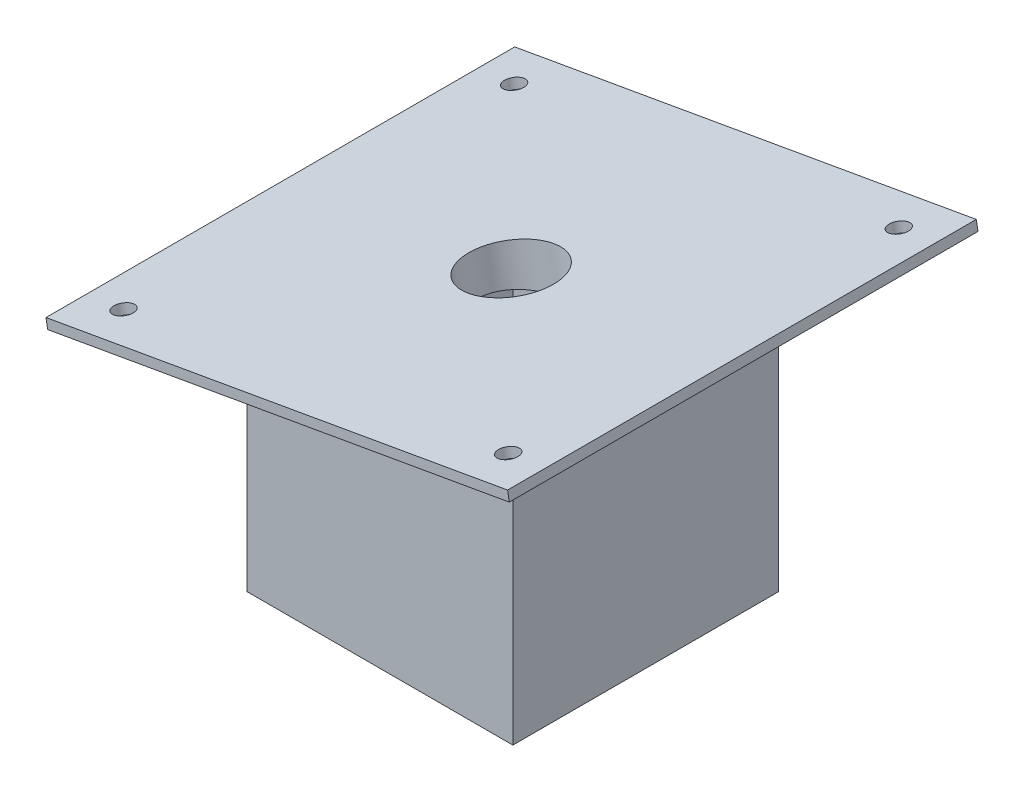
ISO-10303-21;
HEADER;
FILE_DESCRIPTION(('STEP AP214'),'2;1');
FILE_NAME('part.step','',(''),(''),'','','');
FILE_SCHEMA(('AUTOMOTIVE_DESIGN { 1 0 10303 214 1 1 1 1 }'));
ENDSEC;
DATA;
#1=APPLICATION_CONTEXT('core data for automotive mechanical design processes');
#2=APPLICATION_PROTOCOL_DEFINITION('international standard','automotive_design',2000,#1);
#3=PRODUCT_CONTEXT('',#1,'mechanical');
#4=PRODUCT('Part','Part','',(#3));
#5=PRODUCT_RELATED_PRODUCT_CATEGORY('part','',(#4));
#6=PRODUCT_DEFINITION_FORMATION('','',#4);
#7=PRODUCT_DEFINITION_CONTEXT('part definition',#1,'design');
#8=PRODUCT_DEFINITION('design','',#6,#7);
#9=PRODUCT_DEFINITION_SHAPE('','',#8);
#10=(LENGTH_UNIT() NAMED_UNIT(*) SI_UNIT(.MILLI.,.METRE.));
#11=(NAMED_UNIT(*) PLANE_ANGLE_UNIT() SI_UNIT($,.RADIAN.));
#12=(NAMED_UNIT(*) SI_UNIT($,.STERADIAN.) SOLID_ANGLE_UNIT());
#13=UNCERTAINTY_MEASURE_WITH_UNIT(LENGTH_MEASURE(1.E-05),#10,'distance_accuracy_value','');
#14=(GEOMETRIC_REPRESENTATION_CONTEXT(3) GLOBAL_UNCERTAINTY_ASSIGNED_CONTEXT((#13)) GLOBAL_UNIT_ASSIGNED_CONTEXT((#10,
#11,#12)) REPRESENTATION_CONTEXT('',''));
#15=CARTESIAN_POINT('',(0.,0.,0.));
#16=DIRECTION('',(0.,0.,1.));
#17=DIRECTION('',(1.,0.,0.));
#18=AXIS2_PLACEMENT_3D('',#15,#16,#17);
#19=CARTESIAN_POINT('',(-14.9866730086522,84.9936461705283,0.));
#20=DIRECTION('',(-0.173648177666923,0.984807753012209,0.));
#21=DIRECTION('',(-0.984807753012209,-0.173648177666923,0.));
#22=AXIS2_PLACEMENT_3D('',#19,#20,#21);
#23=PLANE('',#22);
#24=CARTESIAN_POINT('',(-62.5352923162753,76.6095416911593,-63.5));
#25=DIRECTION('',(-0.173648177666923,0.984807753012209,0.));
#26=DIRECTION('',(-0.984807753012209,-0.173648177666923,0.));
#27=AXIS2_PLACEMENT_3D('',#24,#25,#26);
#28=CIRCLE('',#27,3.17499999999999);
#29=CARTESIAN_POINT('',(-65.662056932089,76.0582087270668,-63.5));
#30=VERTEX_POINT('',#29);
#31=EDGE_CURVE('E287',#30,#30,#28,.F.);
#32=ORIENTED_EDGE('',*,*,#31,.F.);
#33=EDGE_LOOP('',(#32));
#34=FACE_BOUND('',#33,.T.);
#35=DIRECTION('',(0.,0.,-1.));
#36=VECTOR('',#35,1.);
#37=CARTESIAN_POINT('',(75.0423507795304,100.868192111228,-76.2));
#38=LINE('',#37,#36);
#39=CARTESIAN_POINT('',(75.0423507795304,100.868192111228,76.2));
#40=VERTEX_POINT('',#39);
#41=CARTESIAN_POINT('',(75.0423507795304,100.868192111228,-76.2));
#42=VERTEX_POINT('',#41);
#43=EDGE_CURVE('E162',#40,#42,#38,.T.);
#44=ORIENTED_EDGE('',*,*,#43,.F.);
#45=DIRECTION('',(0.984807753012209,0.173648177666923,0.));
#46=VECTOR('',#45,1.);
#47=CARTESIAN_POINT('',(-75.0423507795303,74.4042098347893,76.2));
#48=LINE('',#47,#46);
#49=CARTESIAN_POINT('',(-75.0423507795303,74.4042098347893,76.2));
#50=VERTEX_POINT('',#49);
#51=EDGE_CURVE('E158',#50,#40,#48,.T.);
#52=ORIENTED_EDGE('',*,*,#51,.F.);
#53=DIRECTION('',(0.,0.,1.));
#54=VECTOR('',#53,1.);
#55=CARTESIAN_POINT('',(-75.0423507795304,74.4042098347893,-76.2));
#56=LINE('',#55,#54);
#57=CARTESIAN_POINT('',(-75.0423507795304,74.4042098347893,-76.2));
#58=VERTEX_POINT('',#57);
#59=EDGE_CURVE('E319',#58,#50,#56,.T.);
#60=ORIENTED_EDGE('',*,*,#59,.F.);
#61=DIRECTION('',(-0.984807753012209,-0.173648177666923,0.));
#62=VECTOR('',#61,1.);
#63=CARTESIAN_POINT('',(-75.0423507795304,74.4042098347893,-76.2));
#64=LINE('',#63,#62);
#65=EDGE_CURVE('E316',#42,#58,#64,.T.);
#66=ORIENTED_EDGE('',*,*,#65,.F.);
#67=EDGE_LOOP('',(#44,#52,#60,#66));
#68=FACE_BOUND('',#67,.T.);
#69=DIRECTION('',(-0.984807753012209,-0.173648177666923,0.));
#70=VECTOR('',#69,1.);
#71=CARTESIAN_POINT('',(43.18,95.25,43.18));
#72=LINE('',#71,#70);
#73=CARTESIAN_POINT('',(43.18,95.2500000000001,43.18));
#74=VERTEX_POINT('',#73);
#75=CARTESIAN_POINT('',(-43.18,80.0224019460176,43.18));
#76=VERTEX_POINT('',#75);
#77=EDGE_CURVE('E168',#74,#76,#72,.T.);
#78=ORIENTED_EDGE('',*,*,#77,.F.);
#79=DIRECTION('',(0.,0.,-1.));
#80=VECTOR('',#79,1.);
#81=CARTESIAN_POINT('',(43.18,95.25,-43.18));
#82=LINE('',#81,#80);
#83=CARTESIAN_POINT('',(43.18,95.2500000000001,-43.18));
#84=VERTEX_POINT('',#83);
#85=EDGE_CURVE('E224',#74,#84,#82,.T.);
#86=ORIENTED_EDGE('',*,*,#85,.T.);
#87=DIRECTION('',(-0.984807753012209,-0.173648177666923,0.));
#88=VECTOR('',#87,1.);
#89=CARTESIAN_POINT('',(43.18,95.25,-43.18));
#90=LINE('',#89,#88);
#91=CARTESIAN_POINT('',(-43.18,80.0224019460177,-43.18));
#92=VERTEX_POINT('',#91);
#93=EDGE_CURVE('E164',#84,#92,#90,.T.);
#94=ORIENTED_EDGE('',*,*,#93,.T.);
#95=DIRECTION('',(0.,0.,-1.));
#96=VECTOR('',#95,1.);
#97=CARTESIAN_POINT('',(-43.18,80.0224019460176,43.18));
#98=LINE('',#97,#96);
#99=EDGE_CURVE('E176',#76,#92,#98,.T.);
#100=ORIENTED_EDGE('',*,*,#99,.F.);
#101=EDGE_LOOP('',(#78,#86,#94,#100));
#102=FACE_BOUND('',#101,.T.);
#103=CARTESIAN_POINT('',(-62.5352923162752,76.6095416911593,63.5));
#104=DIRECTION('',(-0.173648177666923,0.984807753012209,0.));
#105=DIRECTION('',(-0.984807753012209,-0.173648177666923,0.));
#106=AXIS2_PLACEMENT_3D('',#103,#104,#105);
#107=CIRCLE('',#106,3.17499999999999);
#108=CARTESIAN_POINT('',(-65.662056932089,76.0582087270668,63.5));
#109=VERTEX_POINT('',#108);
#110=EDGE_CURVE('E269',#109,#109,#107,.F.);
#111=ORIENTED_EDGE('',*,*,#110,.F.);
#112=EDGE_LOOP('',(#111));
#113=FACE_BOUND('',#112,.T.);
#114=CARTESIAN_POINT('',(62.5352923162753,98.6628602548585,63.5));
#115=DIRECTION('',(-0.173648177666923,0.984807753012209,0.));
#116=DIRECTION('',(-0.984807753012209,-0.173648177666923,0.));
#117=AXIS2_PLACEMENT_3D('',#114,#115,#116);
#118=CIRCLE('',#117,3.17499999999999);
#119=CARTESIAN_POINT('',(59.4085277004615,98.111527290766,63.5));
#120=VERTEX_POINT('',#119);
#121=EDGE_CURVE('E273',#120,#120,#118,.F.);
#122=ORIENTED_EDGE('',*,*,#121,.F.);
#123=EDGE_LOOP('',(#122));
#124=FACE_BOUND('',#123,.T.);
#125=CARTESIAN_POINT('',(62.5352923162753,98.6628602548585,-63.5));
#126=DIRECTION('',(-0.173648177666923,0.984807753012209,0.));
#127=DIRECTION('',(-0.984807753012209,-0.173648177666923,0.));
#128=AXIS2_PLACEMENT_3D('',#125,#126,#127);
#129=CIRCLE('',#128,3.17499999999999);
#130=CARTESIAN_POINT('',(59.4085277004615,98.111527290766,-63.5));
#131=VERTEX_POINT('',#130);
#132=EDGE_CURVE('E276',#131,#131,#129,.F.);
#133=ORIENTED_EDGE('',*,*,#132,.F.);
#134=EDGE_LOOP('',(#133));
#135=FACE_BOUND('',#134,.T.);
#136=ADVANCED_FACE('F45',(#34,#68,#102,#113,#124,#135),#23,.F.);
#137=CARTESIAN_POINT('',(43.18,95.25,-43.18));
#138=DIRECTION('',(-1.,0.,0.));
#139=DIRECTION('',(0.,0.,1.));
#140=AXIS2_PLACEMENT_3D('',#137,#138,#139);
#141=PLANE('',#140);
#142=DIRECTION('',(0.,0.,-1.));
#143=VECTOR('',#142,1.);
#144=CARTESIAN_POINT('',(43.18,0.,-43.18));
#145=LINE('',#144,#143);
#146=CARTESIAN_POINT('',(43.18,0.,43.18));
#147=VERTEX_POINT('',#146);
#148=CARTESIAN_POINT('',(43.18,0.,-43.18));
#149=VERTEX_POINT('',#148);
#150=EDGE_CURVE('E215',#147,#149,#145,.T.);
#151=ORIENTED_EDGE('',*,*,#150,.T.);
#152=DIRECTION('',(0.,-1.,0.));
#153=VECTOR('',#152,1.);
#154=CARTESIAN_POINT('',(43.18,95.25,-43.18));
#155=LINE('',#154,#153);
#156=EDGE_CURVE('E11',#84,#149,#155,.T.);
#157=ORIENTED_EDGE('',*,*,#156,.F.);
#158=ORIENTED_EDGE('',*,*,#85,.F.);
#159=DIRECTION('',(0.,-1.,0.));
#160=VECTOR('',#159,1.);
#161=CARTESIAN_POINT('',(43.18,95.25,43.18));
#162=LINE('',#161,#160);
#163=EDGE_CURVE('E227',#74,#147,#162,.T.);
#164=ORIENTED_EDGE('',*,*,#163,.T.);
#165=EDGE_LOOP('',(#151,#157,#158,#164));
#166=FACE_BOUND('',#165,.T.);
#167=ADVANCED_FACE('F47',(#166),#141,.F.);
#168=CARTESIAN_POINT('',(-43.18,95.25,-43.18));
#169=DIRECTION('',(0.,0.,1.));
#170=DIRECTION('',(1.,0.,0.));
#171=AXIS2_PLACEMENT_3D('',#168,#169,#170);
#172=PLANE('',#171);
#173=DIRECTION('',(0.,-1.,0.));
#174=VECTOR('',#173,1.);
#175=CARTESIAN_POINT('',(-43.18,95.25,-43.18));
#176=LINE('',#175,#174);
#177=CARTESIAN_POINT('',(-43.18,0.,-43.18));
#178=VERTEX_POINT('',#177);
#179=EDGE_CURVE('E54',#92,#178,#176,.T.);
#180=ORIENTED_EDGE('',*,*,#179,.F.);
#181=ORIENTED_EDGE('',*,*,#93,.F.);
#182=ORIENTED_EDGE('',*,*,#156,.T.);
#183=DIRECTION('',(-1.,0.,0.));
#184=VECTOR('',#183,1.);
#185=CARTESIAN_POINT('',(-43.18,0.,-43.18));
#186=LINE('',#185,#184);
#187=EDGE_CURVE('E231',#149,#178,#186,.T.);
#188=ORIENTED_EDGE('',*,*,#187,.T.);
#189=EDGE_LOOP('',(#180,#181,#182,#188));
#190=FACE_BOUND('',#189,.T.);
#191=ADVANCED_FACE('F253',(#190),#172,.F.);
#192=CARTESIAN_POINT('',(-43.18,95.25,-43.18));
#193=DIRECTION('',(1.,0.,0.));
#194=DIRECTION('',(0.,0.,-1.));
#195=AXIS2_PLACEMENT_3D('',#192,#193,#194);
#196=PLANE('',#195);
#197=DIRECTION('',(0.,-1.,0.));
#198=VECTOR('',#197,1.);
#199=CARTESIAN_POINT('',(-43.18,95.25,43.18));
#200=LINE('',#199,#198);
#201=CARTESIAN_POINT('',(-43.18,0.,43.18));
#202=VERTEX_POINT('',#201);
#203=EDGE_CURVE('E243',#76,#202,#200,.T.);
#204=ORIENTED_EDGE('',*,*,#203,.F.);
#205=ORIENTED_EDGE('',*,*,#99,.T.);
#206=ORIENTED_EDGE('',*,*,#179,.T.);
#207=DIRECTION('',(0.,0.,1.));
#208=VECTOR('',#207,1.);
#209=CARTESIAN_POINT('',(-43.18,0.,-43.18));
#210=LINE('',#209,#208);
#211=EDGE_CURVE('E235',#178,#202,#210,.T.);
#212=ORIENTED_EDGE('',*,*,#211,.T.);
#213=EDGE_LOOP('',(#204,#205,#206,#212));
#214=FACE_BOUND('',#213,.T.);
#215=ADVANCED_FACE('F249',(#214),#196,.F.);
#216=CARTESIAN_POINT('',(-43.18,95.25,43.18));
#217=DIRECTION('',(0.,0.,-1.));
#218=DIRECTION('',(-1.,0.,0.));
#219=AXIS2_PLACEMENT_3D('',#216,#217,#218);
#220=PLANE('',#219);
#221=ORIENTED_EDGE('',*,*,#163,.F.);
#222=ORIENTED_EDGE('',*,*,#77,.T.);
#223=ORIENTED_EDGE('',*,*,#203,.T.);
#224=DIRECTION('',(1.,0.,0.));
#225=VECTOR('',#224,1.);
#226=CARTESIAN_POINT('',(-43.18,0.,43.18));
#227=LINE('',#226,#225);
#228=EDGE_CURVE('E69',#202,#147,#227,.T.);
#229=ORIENTED_EDGE('',*,*,#228,.T.);
#230=EDGE_LOOP('',(#221,#222,#223,#229));
#231=FACE_BOUND('',#230,.T.);
#232=ADVANCED_FACE('F260',(#231),#220,.F.);
#233=CARTESIAN_POINT('',(0.,0.,0.));
#234=DIRECTION('',(0.,1.,0.));
#235=DIRECTION('',(0.,0.,1.));
#236=AXIS2_PLACEMENT_3D('',#233,#234,#235);
#237=PLANE('',#236);
#238=DIRECTION('',(-1.,0.,0.));
#239=VECTOR('',#238,1.);
#240=CARTESIAN_POINT('',(-39.37,0.,39.37));
#241=LINE('',#240,#239);
#242=CARTESIAN_POINT('',(39.37,0.,39.37));
#243=VERTEX_POINT('',#242);
#244=CARTESIAN_POINT('',(-39.37,0.,39.37));
#245=VERTEX_POINT('',#244);
#246=EDGE_CURVE('E201',#243,#245,#241,.T.);
#247=ORIENTED_EDGE('',*,*,#246,.F.);
#248=DIRECTION('',(0.,0.,1.));
#249=VECTOR('',#248,1.);
#250=CARTESIAN_POINT('',(39.37,0.,39.37));
#251=LINE('',#250,#249);
#252=CARTESIAN_POINT('',(39.37,0.,-39.37));
#253=VERTEX_POINT('',#252);
#254=EDGE_CURVE('E61',#253,#243,#251,.T.);
#255=ORIENTED_EDGE('',*,*,#254,.F.);
#256=DIRECTION('',(1.,0.,0.));
#257=VECTOR('',#256,1.);
#258=CARTESIAN_POINT('',(-39.37,0.,-39.37));
#259=LINE('',#258,#257);
#260=CARTESIAN_POINT('',(-39.37,0.,-39.37));
#261=VERTEX_POINT('',#260);
#262=EDGE_CURVE('E186',#261,#253,#259,.T.);
#263=ORIENTED_EDGE('',*,*,#262,.F.);
#264=DIRECTION('',(0.,0.,-1.));
#265=VECTOR('',#264,1.);
#266=CARTESIAN_POINT('',(-39.37,0.,39.37));
#267=LINE('',#266,#265);
#268=EDGE_CURVE('E205',#245,#261,#267,.T.);
#269=ORIENTED_EDGE('',*,*,#268,.F.);
#270=EDGE_LOOP('',(#247,#255,#263,#269));
#271=FACE_BOUND('',#270,.T.);
#272=ORIENTED_EDGE('',*,*,#150,.F.);
#273=ORIENTED_EDGE('',*,*,#228,.F.);
#274=ORIENTED_EDGE('',*,*,#211,.F.);
#275=ORIENTED_EDGE('',*,*,#187,.F.);
#276=EDGE_LOOP('',(#272,#273,#274,#275));
#277=FACE_BOUND('',#276,.T.);
#278=ADVANCED_FACE('F257',(#271,#277),#237,.F.);
#279=CARTESIAN_POINT('',(39.37,76.2,39.37));
#280=DIRECTION('',(1.,0.,0.));
#281=DIRECTION('',(0.,0.,-1.));
#282=AXIS2_PLACEMENT_3D('',#279,#280,#281);
#283=PLANE('',#282);
#284=ORIENTED_EDGE('',*,*,#254,.T.);
#285=DIRECTION('',(0.,-1.,0.));
#286=VECTOR('',#285,1.);
#287=CARTESIAN_POINT('',(39.37,76.2,39.37));
#288=LINE('',#287,#286);
#289=CARTESIAN_POINT('',(39.37,76.2,39.37));
#290=VERTEX_POINT('',#289);
#291=EDGE_CURVE('E198',#290,#243,#288,.T.);
#292=ORIENTED_EDGE('',*,*,#291,.F.);
#293=DIRECTION('',(0.,0.,1.));
#294=VECTOR('',#293,1.);
#295=CARTESIAN_POINT('',(39.37,76.2,39.37));
#296=LINE('',#295,#294);
#297=CARTESIAN_POINT('',(39.37,76.2,-39.37));
#298=VERTEX_POINT('',#297);
#299=EDGE_CURVE('E181',#298,#290,#296,.T.);
#300=ORIENTED_EDGE('',*,*,#299,.F.);
#301=DIRECTION('',(0.,-1.,0.));
#302=VECTOR('',#301,1.);
#303=CARTESIAN_POINT('',(39.37,76.2,-39.37));
#304=LINE('',#303,#302);
#305=EDGE_CURVE('E212',#298,#253,#304,.T.);
#306=ORIENTED_EDGE('',*,*,#305,.T.);
#307=EDGE_LOOP('',(#284,#292,#300,#306));
#308=FACE_BOUND('',#307,.T.);
#309=ADVANCED_FACE('F355',(#308),#283,.F.);
#310=CARTESIAN_POINT('',(-39.37,76.2,-39.37));
#311=DIRECTION('',(0.,0.,-1.));
#312=DIRECTION('',(-1.,0.,0.));
#313=AXIS2_PLACEMENT_3D('',#310,#311,#312);
#314=PLANE('',#313);
#315=ORIENTED_EDGE('',*,*,#262,.T.);
#316=ORIENTED_EDGE('',*,*,#305,.F.);
#317=DIRECTION('',(1.,0.,0.));
#318=VECTOR('',#317,1.);
#319=CARTESIAN_POINT('',(-39.37,76.2,-39.37));
#320=LINE('',#319,#318);
#321=CARTESIAN_POINT('',(-39.37,76.2,-39.37));
#322=VERTEX_POINT('',#321);
#323=EDGE_CURVE('E194',#322,#298,#320,.T.);
#324=ORIENTED_EDGE('',*,*,#323,.F.);
#325=DIRECTION('',(0.,-1.,0.));
#326=VECTOR('',#325,1.);
#327=CARTESIAN_POINT('',(-39.37,76.2,-39.37));
#328=LINE('',#327,#326);
#329=EDGE_CURVE('E216',#322,#261,#328,.T.);
#330=ORIENTED_EDGE('',*,*,#329,.T.);
#331=EDGE_LOOP('',(#315,#316,#324,#330));
#332=FACE_BOUND('',#331,.T.);
#333=ADVANCED_FACE('F351',(#332),#314,.F.);
#334=CARTESIAN_POINT('',(-39.37,76.2,39.37));
#335=DIRECTION('',(-1.,0.,0.));
#336=DIRECTION('',(0.,0.,1.));
#337=AXIS2_PLACEMENT_3D('',#334,#335,#336);
#338=PLANE('',#337);
#339=ORIENTED_EDGE('',*,*,#268,.T.);
#340=ORIENTED_EDGE('',*,*,#329,.F.);
#341=DIRECTION('',(0.,0.,-1.));
#342=VECTOR('',#341,1.);
#343=CARTESIAN_POINT('',(-39.37,76.2,39.37));
#344=LINE('',#343,#342);
#345=CARTESIAN_POINT('',(-39.37,76.2,39.37));
#346=VERTEX_POINT('',#345);
#347=EDGE_CURVE('E190',#346,#322,#344,.T.);
#348=ORIENTED_EDGE('',*,*,#347,.F.);
#349=DIRECTION('',(0.,-1.,0.));
#350=VECTOR('',#349,1.);
#351=CARTESIAN_POINT('',(-39.37,76.2,39.37));
#352=LINE('',#351,#350);
#353=EDGE_CURVE('E219',#346,#245,#352,.T.);
#354=ORIENTED_EDGE('',*,*,#353,.T.);
#355=EDGE_LOOP('',(#339,#340,#348,#354));
#356=FACE_BOUND('',#355,.T.);
#357=ADVANCED_FACE('F354',(#356),#338,.F.);
#358=CARTESIAN_POINT('',(-39.37,76.2,39.37));
#359=DIRECTION('',(0.,0.,1.));
#360=DIRECTION('',(1.,0.,0.));
#361=AXIS2_PLACEMENT_3D('',#358,#359,#360);
#362=PLANE('',#361);
#363=ORIENTED_EDGE('',*,*,#246,.T.);
#364=ORIENTED_EDGE('',*,*,#353,.F.);
#365=DIRECTION('',(-1.,0.,0.));
#366=VECTOR('',#365,1.);
#367=CARTESIAN_POINT('',(-39.37,76.2,39.37));
#368=LINE('',#367,#366);
#369=EDGE_CURVE('E185',#290,#346,#368,.T.);
#370=ORIENTED_EDGE('',*,*,#369,.F.);
#371=ORIENTED_EDGE('',*,*,#291,.T.);
#372=EDGE_LOOP('',(#363,#364,#370,#371));
#373=FACE_BOUND('',#372,.T.);
#374=ADVANCED_FACE('F349',(#373),#362,.F.);
#375=CARTESIAN_POINT('',(0.,76.2,0.));
#376=DIRECTION('',(0.,-1.,0.));
#377=DIRECTION('',(0.,0.,-1.));
#378=AXIS2_PLACEMENT_3D('',#375,#376,#377);
#379=PLANE('',#378);
#380=CARTESIAN_POINT('',(2.01651078834575,76.2,0.));
#381=DIRECTION('',(0.,-1.,0.));
#382=DIRECTION('',(-1.,0.,0.));
#383=AXIS2_PLACEMENT_3D('',#380,#381,#382);
#384=ELLIPSE('',#383,14.1855097680438,13.97);
#385=CARTESIAN_POINT('',(-12.1689989796981,76.2,0.));
#386=VERTEX_POINT('',#385);
#387=EDGE_CURVE('E305',#386,#386,#384,.T.);
#388=ORIENTED_EDGE('',*,*,#387,.F.);
#389=EDGE_LOOP('',(#388));
#390=FACE_BOUND('',#389,.T.);
#391=ORIENTED_EDGE('',*,*,#299,.T.);
#392=ORIENTED_EDGE('',*,*,#369,.T.);
#393=ORIENTED_EDGE('',*,*,#347,.T.);
#394=ORIENTED_EDGE('',*,*,#323,.T.);
#395=EDGE_LOOP('',(#391,#392,#393,#394));
#396=FACE_BOUND('',#395,.T.);
#397=ADVANCED_FACE('F346',(#390,#396),#379,.T.);
#398=CARTESIAN_POINT('',(74.4910178154379,103.994956727042,-76.2));
#399=DIRECTION('',(-0.984807753012209,-0.173648177666923,0.));
#400=DIRECTION('',(0.173648177666923,-0.984807753012209,0.));
#401=AXIS2_PLACEMENT_3D('',#398,#399,#400);
#402=PLANE('',#401);
#403=ORIENTED_EDGE('',*,*,#43,.T.);
#404=DIRECTION('',(0.173648177666923,-0.984807753012209,0.));
#405=VECTOR('',#404,1.);
#406=CARTESIAN_POINT('',(74.4910178154379,103.994956727042,-76.2));
#407=LINE('',#406,#405);
#408=CARTESIAN_POINT('',(74.4910178154379,103.994956727042,-76.2));
#409=VERTEX_POINT('',#408);
#410=EDGE_CURVE('E140',#409,#42,#407,.T.);
#411=ORIENTED_EDGE('',*,*,#410,.F.);
#412=DIRECTION('',(0.,0.,-1.));
#413=VECTOR('',#412,1.);
#414=CARTESIAN_POINT('',(74.4910178154379,103.994956727042,-76.2));
#415=LINE('',#414,#413);
#416=CARTESIAN_POINT('',(74.4910178154379,103.994956727042,76.2));
#417=VERTEX_POINT('',#416);
#418=EDGE_CURVE('E148',#417,#409,#415,.T.);
#419=ORIENTED_EDGE('',*,*,#418,.F.);
#420=DIRECTION('',(0.173648177666923,-0.984807753012209,0.));
#421=VECTOR('',#420,1.);
#422=CARTESIAN_POINT('',(74.4910178154379,103.994956727042,76.2));
#423=LINE('',#422,#421);
#424=EDGE_CURVE('E313',#417,#40,#423,.T.);
#425=ORIENTED_EDGE('',*,*,#424,.T.);
#426=EDGE_LOOP('',(#403,#411,#419,#425));
#427=FACE_BOUND('',#426,.T.);
#428=ADVANCED_FACE('F160',(#427),#402,.F.);
#429=CARTESIAN_POINT('',(-75.5936837436228,77.5309744506031,-76.2));
#430=DIRECTION('',(0.,0.,1.));
#431=DIRECTION('',(1.,0.,0.));
#432=AXIS2_PLACEMENT_3D('',#429,#430,#431);
#433=PLANE('',#432);
#434=ORIENTED_EDGE('',*,*,#65,.T.);
#435=DIRECTION('',(0.173648177666923,-0.984807753012209,0.));
#436=VECTOR('',#435,1.);
#437=CARTESIAN_POINT('',(-75.5936837436228,77.5309744506031,-76.2));
#438=LINE('',#437,#436);
#439=CARTESIAN_POINT('',(-75.5936837436228,77.5309744506031,-76.2));
#440=VERTEX_POINT('',#439);
#441=EDGE_CURVE('E143',#440,#58,#438,.T.);
#442=ORIENTED_EDGE('',*,*,#441,.F.);
#443=DIRECTION('',(-0.984807753012209,-0.173648177666923,0.));
#444=VECTOR('',#443,1.);
#445=CARTESIAN_POINT('',(-75.5936837436228,77.5309744506031,-76.2));
#446=LINE('',#445,#444);
#447=EDGE_CURVE('E136',#409,#440,#446,.T.);
#448=ORIENTED_EDGE('',*,*,#447,.F.);
#449=ORIENTED_EDGE('',*,*,#410,.T.);
#450=EDGE_LOOP('',(#434,#442,#448,#449));
#451=FACE_BOUND('',#450,.T.);
#452=ADVANCED_FACE('F138',(#451),#433,.F.);
#453=CARTESIAN_POINT('',(-75.5936837436228,77.5309744506031,-76.2));
#454=DIRECTION('',(0.984807753012209,0.173648177666923,0.));
#455=DIRECTION('',(-0.173648177666923,0.984807753012209,0.));
#456=AXIS2_PLACEMENT_3D('',#453,#454,#455);
#457=PLANE('',#456);
#458=ORIENTED_EDGE('',*,*,#59,.T.);
#459=DIRECTION('',(0.173648177666923,-0.984807753012209,0.));
#460=VECTOR('',#459,1.);
#461=CARTESIAN_POINT('',(-75.5936837436228,77.5309744506031,76.2));
#462=LINE('',#461,#460);
#463=CARTESIAN_POINT('',(-75.5936837436228,77.5309744506031,76.2));
#464=VERTEX_POINT('',#463);
#465=EDGE_CURVE('E170',#464,#50,#462,.T.);
#466=ORIENTED_EDGE('',*,*,#465,.F.);
#467=DIRECTION('',(0.,0.,1.));
#468=VECTOR('',#467,1.);
#469=CARTESIAN_POINT('',(-75.5936837436228,77.5309744506031,-76.2));
#470=LINE('',#469,#468);
#471=EDGE_CURVE('E147',#440,#464,#470,.T.);
#472=ORIENTED_EDGE('',*,*,#471,.F.);
#473=ORIENTED_EDGE('',*,*,#441,.T.);
#474=EDGE_LOOP('',(#458,#466,#472,#473));
#475=FACE_BOUND('',#474,.T.);
#476=ADVANCED_FACE('F334',(#475),#457,.F.);
#477=CARTESIAN_POINT('',(-75.5936837436228,77.5309744506031,76.2));
#478=DIRECTION('',(0.,0.,-1.));
#479=DIRECTION('',(-1.,0.,0.));
#480=AXIS2_PLACEMENT_3D('',#477,#478,#479);
#481=PLANE('',#480);
#482=ORIENTED_EDGE('',*,*,#51,.T.);
#483=ORIENTED_EDGE('',*,*,#424,.F.);
#484=DIRECTION('',(0.984807753012209,0.173648177666923,0.));
#485=VECTOR('',#484,1.);
#486=CARTESIAN_POINT('',(-75.5936837436228,77.5309744506031,76.2));
#487=LINE('',#486,#485);
#488=EDGE_CURVE('E153',#464,#417,#487,.T.);
#489=ORIENTED_EDGE('',*,*,#488,.F.);
#490=ORIENTED_EDGE('',*,*,#465,.T.);
#491=EDGE_LOOP('',(#482,#483,#489,#490));
#492=FACE_BOUND('',#491,.T.);
#493=ADVANCED_FACE('F330',(#492),#481,.F.);
#494=CARTESIAN_POINT('',(-15.5380059727447,88.1204107863421,0.));
#495=DIRECTION('',(-0.173648177666923,0.984807753012209,0.));
#496=DIRECTION('',(-0.984807753012209,-0.173648177666923,0.));
#497=AXIS2_PLACEMENT_3D('',#494,#495,#496);
#498=PLANE('',#497);
#499=CARTESIAN_POINT('',(-63.0866252803678,79.736306306973,-63.5));
#500=DIRECTION('',(-0.173648177666923,0.984807753012209,0.));
#501=DIRECTION('',(-0.984807753012209,-0.173648177666923,0.));
#502=AXIS2_PLACEMENT_3D('',#499,#500,#501);
#503=CIRCLE('',#502,3.17499999999999);
#504=CARTESIAN_POINT('',(-66.2133898961815,79.1849733428806,-63.5));
#505=VERTEX_POINT('',#504);
#506=EDGE_CURVE('E290',#505,#505,#503,.T.);
#507=ORIENTED_EDGE('',*,*,#506,.F.);
#508=EDGE_LOOP('',(#507));
#509=FACE_BOUND('',#508,.T.);
#510=CARTESIAN_POINT('',(61.9839593521828,101.789624870672,-63.5));
#511=DIRECTION('',(-0.173648177666923,0.984807753012209,0.));
#512=DIRECTION('',(-0.984807753012209,-0.173648177666923,0.));
#513=AXIS2_PLACEMENT_3D('',#510,#511,#512);
#514=CIRCLE('',#513,3.17499999999999);
#515=CARTESIAN_POINT('',(58.8571947363691,101.23829190658,-63.5));
#516=VERTEX_POINT('',#515);
#517=EDGE_CURVE('E280',#516,#516,#514,.T.);
#518=ORIENTED_EDGE('',*,*,#517,.F.);
#519=EDGE_LOOP('',(#518));
#520=FACE_BOUND('',#519,.T.);
#521=CARTESIAN_POINT('',(61.9839593521828,101.789624870672,63.5));
#522=DIRECTION('',(-0.173648177666923,0.984807753012209,0.));
#523=DIRECTION('',(-0.984807753012209,-0.173648177666923,0.));
#524=AXIS2_PLACEMENT_3D('',#521,#522,#523);
#525=CIRCLE('',#524,3.17499999999998);
#526=CARTESIAN_POINT('',(58.8571947363691,101.23829190658,63.5));
#527=VERTEX_POINT('',#526);
#528=EDGE_CURVE('E279',#527,#527,#525,.T.);
#529=ORIENTED_EDGE('',*,*,#528,.F.);
#530=EDGE_LOOP('',(#529));
#531=FACE_BOUND('',#530,.T.);
#532=CARTESIAN_POINT('',(-63.0866252803677,79.736306306973,63.5));
#533=DIRECTION('',(-0.173648177666923,0.984807753012209,0.));
#534=DIRECTION('',(-0.984807753012209,-0.173648177666923,0.));
#535=AXIS2_PLACEMENT_3D('',#532,#533,#534);
#536=CIRCLE('',#535,3.17499999999998);
#537=CARTESIAN_POINT('',(-66.2133898961815,79.1849733428806,63.5));
#538=VERTEX_POINT('',#537);
#539=EDGE_CURVE('E294',#538,#538,#536,.T.);
#540=ORIENTED_EDGE('',*,*,#539,.F.);
#541=EDGE_LOOP('',(#540));
#542=FACE_BOUND('',#541,.T.);
#543=CARTESIAN_POINT('',(-0.551332964092511,90.7629655888227,0.));
#544=DIRECTION('',(-0.173648177666923,0.984807753012209,0.));
#545=DIRECTION('',(-0.984807753012209,-0.173648177666923,0.));
#546=AXIS2_PLACEMENT_3D('',#543,#544,#545);
#547=CIRCLE('',#546,13.97);
#548=CARTESIAN_POINT('',(-14.3090972736731,88.3371005468157,0.));
#549=VERTEX_POINT('',#548);
#550=EDGE_CURVE('E298',#549,#549,#547,.T.);
#551=ORIENTED_EDGE('',*,*,#550,.F.);
#552=EDGE_LOOP('',(#551));
#553=FACE_BOUND('',#552,.T.);
#554=ORIENTED_EDGE('',*,*,#418,.T.);
#555=ORIENTED_EDGE('',*,*,#447,.T.);
#556=ORIENTED_EDGE('',*,*,#471,.T.);
#557=ORIENTED_EDGE('',*,*,#488,.T.);
#558=EDGE_LOOP('',(#554,#555,#556,#557));
#559=FACE_BOUND('',#558,.T.);
#560=ADVANCED_FACE('F151',(#509,#520,#531,#542,#553,#559),#498,.T.);
#561=CARTESIAN_POINT('',(17.249476761441,-10.190442982074,0.));
#562=DIRECTION('',(-0.173648177666923,0.984807753012209,0.));
#563=DIRECTION('',(-0.984807753012209,-0.173648177666923,0.));
#564=AXIS2_PLACEMENT_3D('',#561,#562,#563);
#565=CYLINDRICAL_SURFACE('',#564,13.97);
#566=ORIENTED_EDGE('',*,*,#387,.T.);
#567=EDGE_LOOP('',(#566));
#568=FACE_BOUND('',#567,.T.);
#569=ORIENTED_EDGE('',*,*,#550,.T.);
#570=EDGE_LOOP('',(#569));
#571=FACE_BOUND('',#570,.T.);
#572=ADVANCED_FACE('F451',(#568,#571),#565,.F.);
#573=CARTESIAN_POINT('',(-63.0866252803677,79.736306306973,63.5));
#574=DIRECTION('',(-0.173648177666923,0.984807753012209,0.));
#575=DIRECTION('',(-0.984807753012209,-0.173648177666923,0.));
#576=AXIS2_PLACEMENT_3D('',#573,#574,#575);
#577=CYLINDRICAL_SURFACE('',#576,3.17499999999999);
#578=ORIENTED_EDGE('',*,*,#110,.T.);
#579=EDGE_LOOP('',(#578));
#580=FACE_BOUND('',#579,.T.);
#581=ORIENTED_EDGE('',*,*,#539,.T.);
#582=EDGE_LOOP('',(#581));
#583=FACE_BOUND('',#582,.T.);
#584=ADVANCED_FACE('F462',(#580,#583),#577,.F.);
#585=CARTESIAN_POINT('',(61.9839593521828,101.789624870672,63.5));
#586=DIRECTION('',(-0.173648177666923,0.984807753012209,0.));
#587=DIRECTION('',(-0.984807753012209,-0.173648177666923,0.));
#588=AXIS2_PLACEMENT_3D('',#585,#586,#587);
#589=CYLINDRICAL_SURFACE('',#588,3.17499999999999);
#590=ORIENTED_EDGE('',*,*,#121,.T.);
#591=EDGE_LOOP('',(#590));
#592=FACE_BOUND('',#591,.T.);
#593=ORIENTED_EDGE('',*,*,#528,.T.);
#594=EDGE_LOOP('',(#593));
#595=FACE_BOUND('',#594,.T.);
#596=ADVANCED_FACE('F476',(#592,#595),#589,.F.);
#597=CARTESIAN_POINT('',(61.9839593521828,101.789624870672,-63.5));
#598=DIRECTION('',(-0.173648177666923,0.984807753012209,0.));
#599=DIRECTION('',(-0.984807753012209,-0.173648177666923,0.));
#600=AXIS2_PLACEMENT_3D('',#597,#598,#599);
#601=CYLINDRICAL_SURFACE('',#600,3.17499999999999);
#602=ORIENTED_EDGE('',*,*,#132,.T.);
#603=EDGE_LOOP('',(#602));
#604=FACE_BOUND('',#603,.T.);
#605=ORIENTED_EDGE('',*,*,#517,.T.);
#606=EDGE_LOOP('',(#605));
#607=FACE_BOUND('',#606,.T.);
#608=ADVANCED_FACE('F486',(#604,#607),#601,.F.);
#609=CARTESIAN_POINT('',(-63.0866252803678,79.736306306973,-63.5));
#610=DIRECTION('',(-0.173648177666923,0.984807753012209,0.));
#611=DIRECTION('',(-0.984807753012209,-0.173648177666923,0.));
#612=AXIS2_PLACEMENT_3D('',#609,#610,#611);
#613=CYLINDRICAL_SURFACE('',#612,3.17499999999999);
#614=ORIENTED_EDGE('',*,*,#31,.T.);
#615=EDGE_LOOP('',(#614));
#616=FACE_BOUND('',#615,.T.);
#617=ORIENTED_EDGE('',*,*,#506,.T.);
#618=EDGE_LOOP('',(#617));
#619=FACE_BOUND('',#618,.T.);
#620=ADVANCED_FACE('F496',(#616,#619),#613,.F.);
#621=CLOSED_SHELL('',(#136,#167,#191,#215,#232,#278,#309,#333,#357,#374,#397,#428,#452,#476,
#493,#560,#572,#584,#596,#608,#620));
#622=MANIFOLD_SOLID_BREP('B2',#621);
#623=ADVANCED_BREP_SHAPE_REPRESENTATION('',(#18,#622),#14);
#624=SHAPE_DEFINITION_REPRESENTATION(#9,#623);
ENDSEC;
END-ISO-10303-21;
